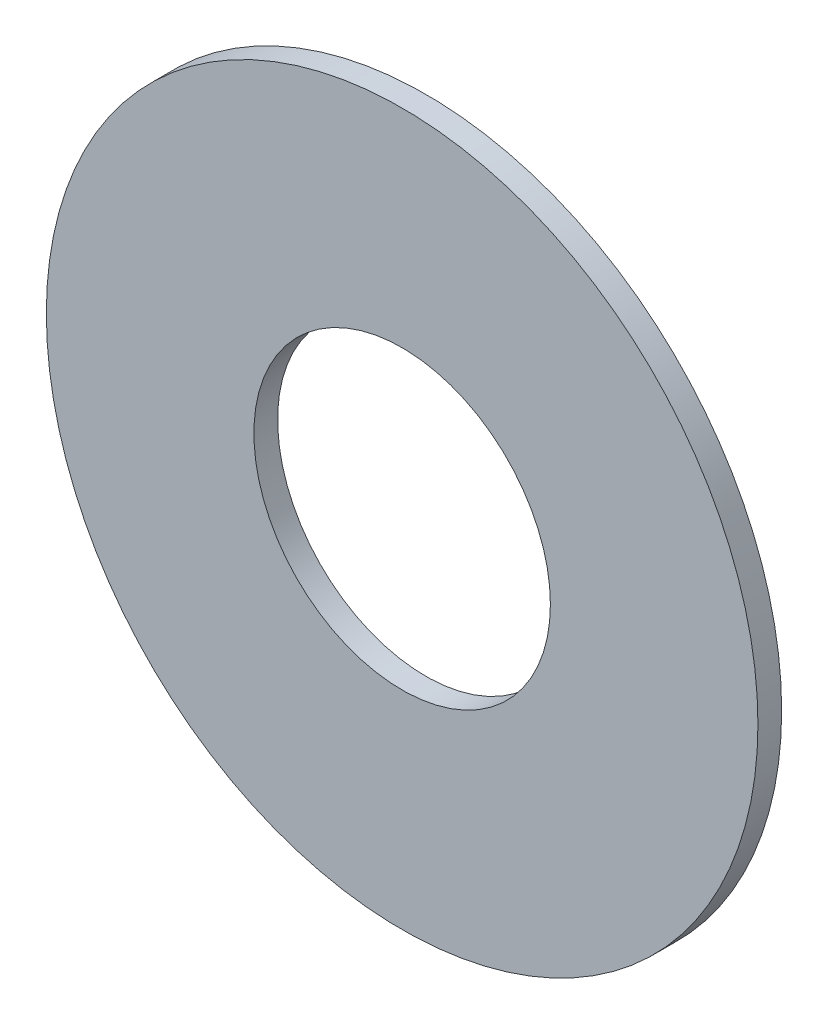
ISO-10303-21;
HEADER;
FILE_DESCRIPTION(('STEP AP214'),'2;1');
FILE_NAME('part.step','',(''),(''),'','','');
FILE_SCHEMA(('AUTOMOTIVE_DESIGN { 1 0 10303 214 1 1 1 1 }'));
ENDSEC;
DATA;
#1=APPLICATION_CONTEXT('core data for automotive mechanical design processes');
#2=APPLICATION_PROTOCOL_DEFINITION('international standard','automotive_design',2000,#1);
#3=PRODUCT_CONTEXT('',#1,'mechanical');
#4=PRODUCT('Part','Part','',(#3));
#5=PRODUCT_RELATED_PRODUCT_CATEGORY('part','',(#4));
#6=PRODUCT_DEFINITION_FORMATION('','',#4);
#7=PRODUCT_DEFINITION_CONTEXT('part definition',#1,'design');
#8=PRODUCT_DEFINITION('design','',#6,#7);
#9=PRODUCT_DEFINITION_SHAPE('','',#8);
#10=(LENGTH_UNIT() NAMED_UNIT(*) SI_UNIT(.MILLI.,.METRE.));
#11=(NAMED_UNIT(*) PLANE_ANGLE_UNIT() SI_UNIT($,.RADIAN.));
#12=(NAMED_UNIT(*) SI_UNIT($,.STERADIAN.) SOLID_ANGLE_UNIT());
#13=UNCERTAINTY_MEASURE_WITH_UNIT(LENGTH_MEASURE(1.E-05),#10,'distance_accuracy_value','');
#14=(GEOMETRIC_REPRESENTATION_CONTEXT(3) GLOBAL_UNCERTAINTY_ASSIGNED_CONTEXT((#13)) GLOBAL_UNIT_ASSIGNED_CONTEXT((#10,
#11,#12)) REPRESENTATION_CONTEXT('',''));
#15=CARTESIAN_POINT('',(0.,0.,0.));
#16=DIRECTION('',(0.,0.,1.));
#17=DIRECTION('',(1.,0.,0.));
#18=AXIS2_PLACEMENT_3D('',#15,#16,#17);
#19=CARTESIAN_POINT('',(0.,0.,12.7));
#20=DIRECTION('',(0.,0.,1.));
#21=DIRECTION('',(1.,0.,0.));
#22=AXIS2_PLACEMENT_3D('',#19,#20,#21);
#23=PLANE('',#22);
#24=CARTESIAN_POINT('',(0.,0.,12.7));
#25=DIRECTION('',(0.,0.,1.));
#26=DIRECTION('',(1.,0.,0.));
#27=AXIS2_PLACEMENT_3D('',#24,#25,#26);
#28=CIRCLE('',#27,190.5);
#29=CARTESIAN_POINT('',(190.5,0.,12.7));
#30=VERTEX_POINT('',#29);
#31=EDGE_CURVE('E10',#30,#30,#28,.T.);
#32=ORIENTED_EDGE('',*,*,#31,.T.);
#33=EDGE_LOOP('',(#32));
#34=FACE_BOUND('',#33,.T.);
#35=CARTESIAN_POINT('',(0.,0.,12.7));
#36=DIRECTION('',(0.,0.,1.));
#37=DIRECTION('',(1.,0.,0.));
#38=AXIS2_PLACEMENT_3D('',#35,#36,#37);
#39=CIRCLE('',#38,79.375);
#40=CARTESIAN_POINT('',(79.375,0.,12.7));
#41=VERTEX_POINT('',#40);
#42=EDGE_CURVE('E56',#41,#41,#39,.T.);
#43=ORIENTED_EDGE('',*,*,#42,.F.);
#44=EDGE_LOOP('',(#43));
#45=FACE_BOUND('',#44,.T.);
#46=ADVANCED_FACE('F43',(#34,#45),#23,.T.);
#47=CARTESIAN_POINT('',(0.,0.,0.));
#48=DIRECTION('',(0.,0.,1.));
#49=DIRECTION('',(1.,0.,0.));
#50=AXIS2_PLACEMENT_3D('',#47,#48,#49);
#51=PLANE('',#50);
#52=CARTESIAN_POINT('',(0.,0.,0.));
#53=DIRECTION('',(0.,0.,1.));
#54=DIRECTION('',(1.,0.,0.));
#55=AXIS2_PLACEMENT_3D('',#52,#53,#54);
#56=CIRCLE('',#55,190.5);
#57=CARTESIAN_POINT('',(190.5,0.,0.));
#58=VERTEX_POINT('',#57);
#59=EDGE_CURVE('E47',#58,#58,#56,.T.);
#60=ORIENTED_EDGE('',*,*,#59,.F.);
#61=EDGE_LOOP('',(#60));
#62=FACE_BOUND('',#61,.T.);
#63=CARTESIAN_POINT('',(0.,0.,0.));
#64=DIRECTION('',(0.,0.,1.));
#65=DIRECTION('',(1.,0.,0.));
#66=AXIS2_PLACEMENT_3D('',#63,#64,#65);
#67=CIRCLE('',#66,79.375);
#68=CARTESIAN_POINT('',(79.375,0.,0.));
#69=VERTEX_POINT('',#68);
#70=EDGE_CURVE('E58',#69,#69,#67,.T.);
#71=ORIENTED_EDGE('',*,*,#70,.T.);
#72=EDGE_LOOP('',(#71));
#73=FACE_BOUND('',#72,.T.);
#74=ADVANCED_FACE('F70',(#62,#73),#51,.F.);
#75=CARTESIAN_POINT('',(0.,0.,12.7));
#76=DIRECTION('',(0.,0.,-1.));
#77=DIRECTION('',(-1.,0.,0.));
#78=AXIS2_PLACEMENT_3D('',#75,#76,#77);
#79=CYLINDRICAL_SURFACE('',#78,190.5);
#80=ORIENTED_EDGE('',*,*,#31,.F.);
#81=EDGE_LOOP('',(#80));
#82=FACE_BOUND('',#81,.T.);
#83=ORIENTED_EDGE('',*,*,#59,.T.);
#84=EDGE_LOOP('',(#83));
#85=FACE_BOUND('',#84,.T.);
#86=ADVANCED_FACE('F45',(#82,#85),#79,.T.);
#87=CARTESIAN_POINT('',(0.,0.,12.7));
#88=DIRECTION('',(0.,0.,-1.));
#89=DIRECTION('',(-1.,0.,0.));
#90=AXIS2_PLACEMENT_3D('',#87,#88,#89);
#91=CYLINDRICAL_SURFACE('',#90,79.375);
#92=ORIENTED_EDGE('',*,*,#42,.T.);
#93=EDGE_LOOP('',(#92));
#94=FACE_BOUND('',#93,.T.);
#95=ORIENTED_EDGE('',*,*,#70,.F.);
#96=EDGE_LOOP('',(#95));
#97=FACE_BOUND('',#96,.T.);
#98=ADVANCED_FACE('F66',(#94,#97),#91,.F.);
#99=CLOSED_SHELL('',(#46,#74,#86,#98));
#100=MANIFOLD_SOLID_BREP('B2',#99);
#101=ADVANCED_BREP_SHAPE_REPRESENTATION('',(#18,#100),#14);
#102=SHAPE_DEFINITION_REPRESENTATION(#9,#101);
ENDSEC;
END-ISO-10303-21;
